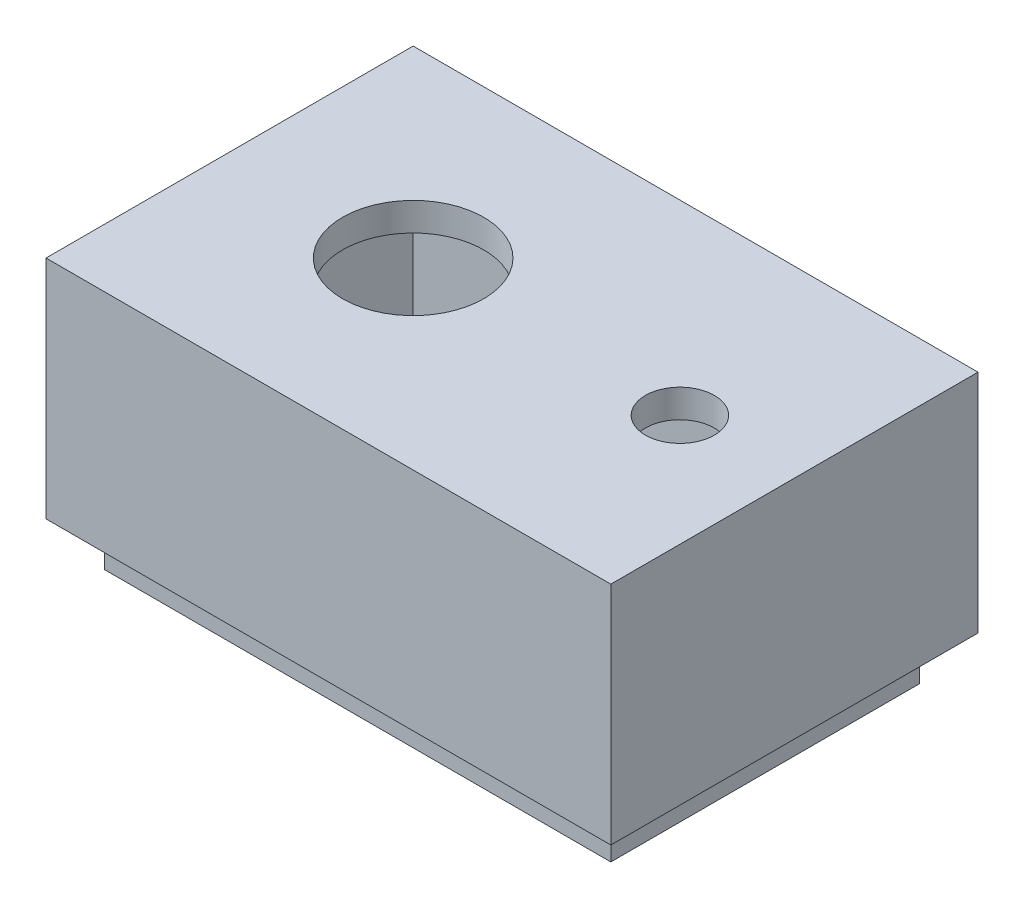
ISO-10303-21;
HEADER;
FILE_DESCRIPTION(('STEP AP214'),'2;1');
FILE_NAME('part.step','',(''),(''),'','','');
FILE_SCHEMA(('AUTOMOTIVE_DESIGN { 1 0 10303 214 1 1 1 1 }'));
ENDSEC;
DATA;
#1=APPLICATION_CONTEXT('core data for automotive mechanical design processes');
#2=APPLICATION_PROTOCOL_DEFINITION('international standard','automotive_design',2000,#1);
#3=PRODUCT_CONTEXT('',#1,'mechanical');
#4=PRODUCT('Part','Part','',(#3));
#5=PRODUCT_RELATED_PRODUCT_CATEGORY('part','',(#4));
#6=PRODUCT_DEFINITION_FORMATION('','',#4);
#7=PRODUCT_DEFINITION_CONTEXT('part definition',#1,'design');
#8=PRODUCT_DEFINITION('design','',#6,#7);
#9=PRODUCT_DEFINITION_SHAPE('','',#8);
#10=(LENGTH_UNIT() NAMED_UNIT(*) SI_UNIT(.MILLI.,.METRE.));
#11=(NAMED_UNIT(*) PLANE_ANGLE_UNIT() SI_UNIT($,.RADIAN.));
#12=(NAMED_UNIT(*) SI_UNIT($,.STERADIAN.) SOLID_ANGLE_UNIT());
#13=UNCERTAINTY_MEASURE_WITH_UNIT(LENGTH_MEASURE(1.E-05),#10,'distance_accuracy_value','');
#14=(GEOMETRIC_REPRESENTATION_CONTEXT(3) GLOBAL_UNCERTAINTY_ASSIGNED_CONTEXT((#13)) GLOBAL_UNIT_ASSIGNED_CONTEXT((#10,
#11,#12)) REPRESENTATION_CONTEXT('',''));
#15=CARTESIAN_POINT('',(0.,0.,0.));
#16=DIRECTION('',(0.,0.,1.));
#17=DIRECTION('',(1.,0.,0.));
#18=AXIS2_PLACEMENT_3D('',#15,#16,#17);
#19=CARTESIAN_POINT('',(0.,40.,0.));
#20=DIRECTION('',(0.,1.,0.));
#21=DIRECTION('',(0.,0.,1.));
#22=AXIS2_PLACEMENT_3D('',#19,#20,#21);
#23=PLANE('',#22);
#24=DIRECTION('',(0.,0.,1.));
#25=VECTOR('',#24,1.);
#26=CARTESIAN_POINT('',(55.9322033898305,40.,29.9992295839753));
#27=LINE('',#26,#25);
#28=CARTESIAN_POINT('',(55.9322033898305,40.,-33.0007704160247));
#29=VERTEX_POINT('',#28);
#30=CARTESIAN_POINT('',(55.9322033898305,40.,31.9992295839753));
#31=VERTEX_POINT('',#30);
#32=EDGE_CURVE('E94',#29,#31,#27,.T.);
#33=ORIENTED_EDGE('',*,*,#32,.T.);
#34=DIRECTION('',(1.,0.,0.));
#35=VECTOR('',#34,1.);
#36=CARTESIAN_POINT('',(-44.0677966101695,40.,31.9992295839753));
#37=LINE('',#36,#35);
#38=CARTESIAN_POINT('',(-44.0677966101695,40.,31.9992295839753));
#39=VERTEX_POINT('',#38);
#40=EDGE_CURVE('E251',#39,#31,#37,.T.);
#41=ORIENTED_EDGE('',*,*,#40,.F.);
#42=DIRECTION('',(0.,0.,1.));
#43=VECTOR('',#42,1.);
#44=CARTESIAN_POINT('',(-44.0677966101695,40.,-33.0007704160247));
#45=LINE('',#44,#43);
#46=CARTESIAN_POINT('',(-44.0677966101695,40.,-33.0007704160247));
#47=VERTEX_POINT('',#46);
#48=EDGE_CURVE('E237',#47,#39,#45,.T.);
#49=ORIENTED_EDGE('',*,*,#48,.F.);
#50=DIRECTION('',(-1.,0.,0.));
#51=VECTOR('',#50,1.);
#52=CARTESIAN_POINT('',(-44.0677966101695,40.,-33.0007704160247));
#53=LINE('',#52,#51);
#54=EDGE_CURVE('E249',#29,#47,#53,.T.);
#55=ORIENTED_EDGE('',*,*,#54,.F.);
#56=EDGE_LOOP('',(#33,#41,#49,#55));
#57=FACE_BOUND('',#56,.T.);
#58=DIRECTION('',(0.,0.,-1.));
#59=VECTOR('',#58,1.);
#60=CARTESIAN_POINT('',(-38.8677966101695,40.,26.7992295839754));
#61=LINE('',#60,#59);
#62=CARTESIAN_POINT('',(-38.8677966101695,40.,26.7992295839754));
#63=VERTEX_POINT('',#62);
#64=CARTESIAN_POINT('',(-38.8677966101695,40.,-27.8007704160247));
#65=VERTEX_POINT('',#64);
#66=EDGE_CURVE('E279',#63,#65,#61,.T.);
#67=ORIENTED_EDGE('',*,*,#66,.F.);
#68=DIRECTION('',(-1.,0.,0.));
#69=VECTOR('',#68,1.);
#70=CARTESIAN_POINT('',(-38.8677966101695,40.,26.7992295839754));
#71=LINE('',#70,#69);
#72=CARTESIAN_POINT('',(50.7322033898305,40.,26.7992295839754));
#73=VERTEX_POINT('',#72);
#74=EDGE_CURVE('E190',#73,#63,#71,.T.);
#75=ORIENTED_EDGE('',*,*,#74,.F.);
#76=DIRECTION('',(0.,0.,1.));
#77=VECTOR('',#76,1.);
#78=CARTESIAN_POINT('',(50.7322033898305,40.,26.7992295839754));
#79=LINE('',#78,#77);
#80=CARTESIAN_POINT('',(50.7322033898305,40.,-27.8007704160247));
#81=VERTEX_POINT('',#80);
#82=EDGE_CURVE('E195',#81,#73,#79,.T.);
#83=ORIENTED_EDGE('',*,*,#82,.F.);
#84=DIRECTION('',(1.,0.,0.));
#85=VECTOR('',#84,1.);
#86=CARTESIAN_POINT('',(-38.8677966101695,40.,-27.8007704160247));
#87=LINE('',#86,#85);
#88=EDGE_CURVE('E283',#65,#81,#87,.T.);
#89=ORIENTED_EDGE('',*,*,#88,.F.);
#90=EDGE_LOOP('',(#67,#75,#83,#89));
#91=FACE_BOUND('',#90,.T.);
#92=ADVANCED_FACE('F87',(#57,#91),#23,.F.);
#93=CARTESIAN_POINT('',(55.9322033898305,80.,-33.0007704160247));
#94=DIRECTION('',(-1.,0.,0.));
#95=DIRECTION('',(0.,0.,1.));
#96=AXIS2_PLACEMENT_3D('',#93,#94,#95);
#97=PLANE('',#96);
#98=DIRECTION('',(0.,-1.,0.));
#99=VECTOR('',#98,1.);
#100=CARTESIAN_POINT('',(55.9322033898305,80.,-33.0007704160247));
#101=LINE('',#100,#99);
#102=CARTESIAN_POINT('',(55.9322033898305,80.,-33.0007704160247));
#103=VERTEX_POINT('',#102);
#104=EDGE_CURVE('E224',#103,#29,#101,.T.);
#105=ORIENTED_EDGE('',*,*,#104,.F.);
#106=DIRECTION('',(0.,0.,-1.));
#107=VECTOR('',#106,1.);
#108=CARTESIAN_POINT('',(55.9322033898305,80.,-33.0007704160247));
#109=LINE('',#108,#107);
#110=CARTESIAN_POINT('',(55.9322033898305,80.,31.9992295839753));
#111=VERTEX_POINT('',#110);
#112=EDGE_CURVE('E242',#111,#103,#109,.T.);
#113=ORIENTED_EDGE('',*,*,#112,.F.);
#114=DIRECTION('',(0.,-1.,0.));
#115=VECTOR('',#114,1.);
#116=CARTESIAN_POINT('',(55.9322033898305,80.,31.9992295839753));
#117=LINE('',#116,#115);
#118=EDGE_CURVE('E221',#111,#31,#117,.T.);
#119=ORIENTED_EDGE('',*,*,#118,.T.);
#120=ORIENTED_EDGE('',*,*,#32,.F.);
#121=EDGE_LOOP('',(#105,#113,#119,#120));
#122=FACE_BOUND('',#121,.T.);
#123=ADVANCED_FACE('F264',(#122),#97,.F.);
#124=CARTESIAN_POINT('',(0.,75.,0.));
#125=DIRECTION('',(0.,1.,0.));
#126=DIRECTION('',(0.,0.,1.));
#127=AXIS2_PLACEMENT_3D('',#124,#125,#126);
#128=PLANE('',#127);
#129=DIRECTION('',(-1.,0.,0.));
#130=VECTOR('',#129,1.);
#131=CARTESIAN_POINT('',(-39.0677966101695,75.,25.7992295839754));
#132=LINE('',#131,#130);
#133=CARTESIAN_POINT('',(49.7322033898305,75.,25.7992295839754));
#134=VERTEX_POINT('',#133);
#135=CARTESIAN_POINT('',(-37.8677966101695,75.,25.7992295839754));
#136=VERTEX_POINT('',#135);
#137=EDGE_CURVE('E210',#134,#136,#132,.T.);
#138=ORIENTED_EDGE('',*,*,#137,.T.);
#139=DIRECTION('',(0.,0.,-1.));
#140=VECTOR('',#139,1.);
#141=CARTESIAN_POINT('',(-37.8677966101695,75.,26.9992295839753));
#142=LINE('',#141,#140);
#143=CARTESIAN_POINT('',(-37.8677966101695,75.,-26.8007704160247));
#144=VERTEX_POINT('',#143);
#145=EDGE_CURVE('E201',#136,#144,#142,.T.);
#146=ORIENTED_EDGE('',*,*,#145,.T.);
#147=DIRECTION('',(1.,0.,0.));
#148=VECTOR('',#147,1.);
#149=CARTESIAN_POINT('',(-39.0677966101695,75.,-26.8007704160247));
#150=LINE('',#149,#148);
#151=CARTESIAN_POINT('',(49.7322033898305,75.,-26.8007704160247));
#152=VERTEX_POINT('',#151);
#153=EDGE_CURVE('E204',#144,#152,#150,.T.);
#154=ORIENTED_EDGE('',*,*,#153,.T.);
#155=DIRECTION('',(0.,0.,1.));
#156=VECTOR('',#155,1.);
#157=CARTESIAN_POINT('',(49.7322033898305,75.,26.9992295839753));
#158=LINE('',#157,#156);
#159=EDGE_CURVE('E207',#152,#134,#158,.T.);
#160=ORIENTED_EDGE('',*,*,#159,.T.);
#161=EDGE_LOOP('',(#138,#146,#154,#160));
#162=FACE_BOUND('',#161,.T.);
#163=CARTESIAN_POINT('',(36.1553778472485,75.,0.));
#164=DIRECTION('',(0.,1.,0.));
#165=DIRECTION('',(0.,0.,1.));
#166=AXIS2_PLACEMENT_3D('',#163,#164,#165);
#167=CIRCLE('',#166,6.10322585973708);
#168=CARTESIAN_POINT('',(36.1553778472485,75.,6.10322585973708));
#169=VERTEX_POINT('',#168);
#170=EDGE_CURVE('E238',#169,#169,#167,.T.);
#171=ORIENTED_EDGE('',*,*,#170,.T.);
#172=EDGE_LOOP('',(#171));
#173=FACE_BOUND('',#172,.T.);
#174=CARTESIAN_POINT('',(-11.5677966101695,75.,-0.50077041602465));
#175=DIRECTION('',(0.,1.,0.));
#176=DIRECTION('',(0.,0.,1.));
#177=AXIS2_PLACEMENT_3D('',#174,#175,#176);
#178=CIRCLE('',#177,12.5);
#179=CARTESIAN_POINT('',(-11.5677966101695,75.,11.9992295839754));
#180=VERTEX_POINT('',#179);
#181=EDGE_CURVE('E284',#180,#180,#178,.T.);
#182=ORIENTED_EDGE('',*,*,#181,.T.);
#183=EDGE_LOOP('',(#182));
#184=FACE_BOUND('',#183,.T.);
#185=ADVANCED_FACE('F319',(#162,#173,#184),#128,.F.);
#186=CARTESIAN_POINT('',(36.1553778472485,75.,0.));
#187=DIRECTION('',(0.,1.,0.));
#188=DIRECTION('',(0.,0.,1.));
#189=AXIS2_PLACEMENT_3D('',#186,#187,#188);
#190=CYLINDRICAL_SURFACE('',#189,6.10322585973708);
#191=ORIENTED_EDGE('',*,*,#170,.F.);
#192=EDGE_LOOP('',(#191));
#193=FACE_BOUND('',#192,.T.);
#194=CARTESIAN_POINT('',(36.1553778472485,80.,0.));
#195=DIRECTION('',(0.,1.,0.));
#196=DIRECTION('',(0.,0.,1.));
#197=AXIS2_PLACEMENT_3D('',#194,#195,#196);
#198=CIRCLE('',#197,6.10322585973708);
#199=CARTESIAN_POINT('',(36.1553778472485,80.,6.10322585973708));
#200=VERTEX_POINT('',#199);
#201=EDGE_CURVE('E234',#200,#200,#198,.T.);
#202=ORIENTED_EDGE('',*,*,#201,.T.);
#203=EDGE_LOOP('',(#202));
#204=FACE_BOUND('',#203,.T.);
#205=ADVANCED_FACE('F327',(#193,#204),#190,.F.);
#206=CARTESIAN_POINT('',(-44.0677966101695,80.,-33.0007704160247));
#207=DIRECTION('',(0.,0.,1.));
#208=DIRECTION('',(1.,0.,0.));
#209=AXIS2_PLACEMENT_3D('',#206,#207,#208);
#210=PLANE('',#209);
#211=DIRECTION('',(0.,-1.,0.));
#212=VECTOR('',#211,1.);
#213=CARTESIAN_POINT('',(-44.0677966101695,80.,-33.0007704160247));
#214=LINE('',#213,#212);
#215=CARTESIAN_POINT('',(-44.0677966101695,80.,-33.0007704160247));
#216=VERTEX_POINT('',#215);
#217=EDGE_CURVE('E227',#216,#47,#214,.T.);
#218=ORIENTED_EDGE('',*,*,#217,.F.);
#219=DIRECTION('',(-1.,0.,0.));
#220=VECTOR('',#219,1.);
#221=CARTESIAN_POINT('',(-44.0677966101695,80.,-33.0007704160247));
#222=LINE('',#221,#220);
#223=EDGE_CURVE('E233',#103,#216,#222,.T.);
#224=ORIENTED_EDGE('',*,*,#223,.F.);
#225=ORIENTED_EDGE('',*,*,#104,.T.);
#226=ORIENTED_EDGE('',*,*,#54,.T.);
#227=EDGE_LOOP('',(#218,#224,#225,#226));
#228=FACE_BOUND('',#227,.T.);
#229=ADVANCED_FACE('F273',(#228),#210,.F.);
#230=CARTESIAN_POINT('',(-44.0677966101695,80.,31.9992295839753));
#231=DIRECTION('',(0.,0.,-1.));
#232=DIRECTION('',(-1.,0.,0.));
#233=AXIS2_PLACEMENT_3D('',#230,#231,#232);
#234=PLANE('',#233);
#235=ORIENTED_EDGE('',*,*,#40,.T.);
#236=ORIENTED_EDGE('',*,*,#118,.F.);
#237=DIRECTION('',(1.,0.,0.));
#238=VECTOR('',#237,1.);
#239=CARTESIAN_POINT('',(-44.0677966101695,80.,31.9992295839753));
#240=LINE('',#239,#238);
#241=CARTESIAN_POINT('',(-44.0677966101695,80.,31.9992295839753));
#242=VERTEX_POINT('',#241);
#243=EDGE_CURVE('E244',#242,#111,#240,.T.);
#244=ORIENTED_EDGE('',*,*,#243,.F.);
#245=DIRECTION('',(0.,-1.,0.));
#246=VECTOR('',#245,1.);
#247=CARTESIAN_POINT('',(-44.0677966101695,80.,31.9992295839753));
#248=LINE('',#247,#246);
#249=EDGE_CURVE('E230',#242,#39,#248,.T.);
#250=ORIENTED_EDGE('',*,*,#249,.T.);
#251=EDGE_LOOP('',(#235,#236,#244,#250));
#252=FACE_BOUND('',#251,.T.);
#253=ADVANCED_FACE('F256',(#252),#234,.F.);
#254=CARTESIAN_POINT('',(-44.0677966101695,80.,-33.0007704160247));
#255=DIRECTION('',(1.,0.,0.));
#256=DIRECTION('',(0.,0.,-1.));
#257=AXIS2_PLACEMENT_3D('',#254,#255,#256);
#258=PLANE('',#257);
#259=ORIENTED_EDGE('',*,*,#249,.F.);
#260=DIRECTION('',(0.,0.,1.));
#261=VECTOR('',#260,1.);
#262=CARTESIAN_POINT('',(-44.0677966101695,80.,-33.0007704160247));
#263=LINE('',#262,#261);
#264=EDGE_CURVE('E241',#216,#242,#263,.T.);
#265=ORIENTED_EDGE('',*,*,#264,.F.);
#266=ORIENTED_EDGE('',*,*,#217,.T.);
#267=ORIENTED_EDGE('',*,*,#48,.T.);
#268=EDGE_LOOP('',(#259,#265,#266,#267));
#269=FACE_BOUND('',#268,.T.);
#270=ADVANCED_FACE('F275',(#269),#258,.F.);
#271=CARTESIAN_POINT('',(0.,80.,0.));
#272=DIRECTION('',(0.,1.,0.));
#273=DIRECTION('',(0.,0.,1.));
#274=AXIS2_PLACEMENT_3D('',#271,#272,#273);
#275=PLANE('',#274);
#276=ORIENTED_EDGE('',*,*,#243,.T.);
#277=ORIENTED_EDGE('',*,*,#112,.T.);
#278=ORIENTED_EDGE('',*,*,#223,.T.);
#279=ORIENTED_EDGE('',*,*,#264,.T.);
#280=EDGE_LOOP('',(#276,#277,#278,#279));
#281=FACE_BOUND('',#280,.T.);
#282=ORIENTED_EDGE('',*,*,#201,.F.);
#283=EDGE_LOOP('',(#282));
#284=FACE_BOUND('',#283,.T.);
#285=CARTESIAN_POINT('',(-11.5677966101695,80.,-0.50077041602465));
#286=DIRECTION('',(0.,1.,0.));
#287=DIRECTION('',(0.,0.,1.));
#288=AXIS2_PLACEMENT_3D('',#285,#286,#287);
#289=CIRCLE('',#288,12.5);
#290=CARTESIAN_POINT('',(-11.5677966101695,80.,11.9992295839754));
#291=VERTEX_POINT('',#290);
#292=EDGE_CURVE('E288',#291,#291,#289,.T.);
#293=ORIENTED_EDGE('',*,*,#292,.F.);
#294=EDGE_LOOP('',(#293));
#295=FACE_BOUND('',#294,.T.);
#296=ADVANCED_FACE('F268',(#281,#284,#295),#275,.T.);
#297=CARTESIAN_POINT('',(-37.8677966101695,40.,26.9992295839753));
#298=DIRECTION('',(1.,0.,0.));
#299=DIRECTION('',(0.,0.,-1.));
#300=AXIS2_PLACEMENT_3D('',#297,#298,#299);
#301=PLANE('',#300);
#302=DIRECTION('',(0.,0.,1.));
#303=VECTOR('',#302,1.);
#304=CARTESIAN_POINT('',(-37.8677966101695,32.2018522868434,26.9992295839753));
#305=LINE('',#304,#303);
#306=CARTESIAN_POINT('',(-37.8677966101695,32.2018522868434,-26.8007704160247));
#307=VERTEX_POINT('',#306);
#308=CARTESIAN_POINT('',(-37.8677966101695,32.2018522868434,25.7992295839754));
#309=VERTEX_POINT('',#308);
#310=EDGE_CURVE('E101',#307,#309,#305,.T.);
#311=ORIENTED_EDGE('',*,*,#310,.F.);
#312=DIRECTION('',(0.,1.,0.));
#313=VECTOR('',#312,1.);
#314=CARTESIAN_POINT('',(-37.8677966101695,40.,-26.8007704160247));
#315=LINE('',#314,#313);
#316=EDGE_CURVE('E219',#307,#144,#315,.T.);
#317=ORIENTED_EDGE('',*,*,#316,.T.);
#318=ORIENTED_EDGE('',*,*,#145,.F.);
#319=DIRECTION('',(0.,1.,0.));
#320=VECTOR('',#319,1.);
#321=CARTESIAN_POINT('',(-37.8677966101695,40.,25.7992295839754));
#322=LINE('',#321,#320);
#323=EDGE_CURVE('E213',#309,#136,#322,.T.);
#324=ORIENTED_EDGE('',*,*,#323,.F.);
#325=EDGE_LOOP('',(#311,#317,#318,#324));
#326=FACE_BOUND('',#325,.T.);
#327=ADVANCED_FACE('F311',(#326),#301,.T.);
#328=CARTESIAN_POINT('',(-39.0677966101695,40.,-26.8007704160247));
#329=DIRECTION('',(0.,0.,1.));
#330=DIRECTION('',(1.,0.,0.));
#331=AXIS2_PLACEMENT_3D('',#328,#329,#330);
#332=PLANE('',#331);
#333=DIRECTION('',(-1.,0.,0.));
#334=VECTOR('',#333,1.);
#335=CARTESIAN_POINT('',(-39.0677966101695,32.2018522868434,-26.8007704160247));
#336=LINE('',#335,#334);
#337=CARTESIAN_POINT('',(49.7322033898305,32.2018522868434,-26.8007704160247));
#338=VERTEX_POINT('',#337);
#339=EDGE_CURVE('E303',#338,#307,#336,.T.);
#340=ORIENTED_EDGE('',*,*,#339,.F.);
#341=DIRECTION('',(0.,1.,0.));
#342=VECTOR('',#341,1.);
#343=CARTESIAN_POINT('',(49.7322033898305,40.,-26.8007704160247));
#344=LINE('',#343,#342);
#345=EDGE_CURVE('E217',#338,#152,#344,.T.);
#346=ORIENTED_EDGE('',*,*,#345,.T.);
#347=ORIENTED_EDGE('',*,*,#153,.F.);
#348=ORIENTED_EDGE('',*,*,#316,.F.);
#349=EDGE_LOOP('',(#340,#346,#347,#348));
#350=FACE_BOUND('',#349,.T.);
#351=ADVANCED_FACE('F316',(#350),#332,.T.);
#352=CARTESIAN_POINT('',(49.7322033898305,40.,26.9992295839753));
#353=DIRECTION('',(-1.,0.,0.));
#354=DIRECTION('',(0.,0.,1.));
#355=AXIS2_PLACEMENT_3D('',#352,#353,#354);
#356=PLANE('',#355);
#357=DIRECTION('',(0.,0.,-1.));
#358=VECTOR('',#357,1.);
#359=CARTESIAN_POINT('',(49.7322033898305,32.2018522868434,26.9992295839753));
#360=LINE('',#359,#358);
#361=CARTESIAN_POINT('',(49.7322033898305,32.2018522868434,25.7992295839754));
#362=VERTEX_POINT('',#361);
#363=EDGE_CURVE('E301',#362,#338,#360,.T.);
#364=ORIENTED_EDGE('',*,*,#363,.F.);
#365=DIRECTION('',(0.,1.,0.));
#366=VECTOR('',#365,1.);
#367=CARTESIAN_POINT('',(49.7322033898305,40.,25.7992295839754));
#368=LINE('',#367,#366);
#369=EDGE_CURVE('E215',#362,#134,#368,.T.);
#370=ORIENTED_EDGE('',*,*,#369,.T.);
#371=ORIENTED_EDGE('',*,*,#159,.F.);
#372=ORIENTED_EDGE('',*,*,#345,.F.);
#373=EDGE_LOOP('',(#364,#370,#371,#372));
#374=FACE_BOUND('',#373,.T.);
#375=ADVANCED_FACE('F368',(#374),#356,.T.);
#376=CARTESIAN_POINT('',(-39.0677966101695,40.,25.7992295839754));
#377=DIRECTION('',(0.,0.,-1.));
#378=DIRECTION('',(-1.,0.,0.));
#379=AXIS2_PLACEMENT_3D('',#376,#377,#378);
#380=PLANE('',#379);
#381=DIRECTION('',(1.,0.,0.));
#382=VECTOR('',#381,1.);
#383=CARTESIAN_POINT('',(-39.0677966101695,32.2018522868434,25.7992295839754));
#384=LINE('',#383,#382);
#385=EDGE_CURVE('E297',#309,#362,#384,.T.);
#386=ORIENTED_EDGE('',*,*,#385,.F.);
#387=ORIENTED_EDGE('',*,*,#323,.T.);
#388=ORIENTED_EDGE('',*,*,#137,.F.);
#389=ORIENTED_EDGE('',*,*,#369,.F.);
#390=EDGE_LOOP('',(#386,#387,#388,#389));
#391=FACE_BOUND('',#390,.T.);
#392=ADVANCED_FACE('F365',(#391),#380,.T.);
#393=CARTESIAN_POINT('',(-38.8677966101695,5.,26.7992295839754));
#394=DIRECTION('',(1.,0.,0.));
#395=DIRECTION('',(0.,0.,-1.));
#396=AXIS2_PLACEMENT_3D('',#393,#394,#395);
#397=PLANE('',#396);
#398=DIRECTION('',(0.,1.,0.));
#399=VECTOR('',#398,1.);
#400=CARTESIAN_POINT('',(-38.8677966101695,5.,-27.8007704160247));
#401=LINE('',#400,#399);
#402=CARTESIAN_POINT('',(-38.8677966101695,32.2018522868434,-27.8007704160247));
#403=VERTEX_POINT('',#402);
#404=EDGE_CURVE('E184',#403,#65,#401,.T.);
#405=ORIENTED_EDGE('',*,*,#404,.F.);
#406=DIRECTION('',(0.,0.,-1.));
#407=VECTOR('',#406,1.);
#408=CARTESIAN_POINT('',(-38.8677966101695,32.2018522868434,-27.8007704160247));
#409=LINE('',#408,#407);
#410=CARTESIAN_POINT('',(-38.8677966101695,32.2018522868434,26.7992295839754));
#411=VERTEX_POINT('',#410);
#412=EDGE_CURVE('E173',#411,#403,#409,.T.);
#413=ORIENTED_EDGE('',*,*,#412,.F.);
#414=DIRECTION('',(0.,1.,0.));
#415=VECTOR('',#414,1.);
#416=CARTESIAN_POINT('',(-38.8677966101695,5.,26.7992295839754));
#417=LINE('',#416,#415);
#418=EDGE_CURVE('E182',#411,#63,#417,.T.);
#419=ORIENTED_EDGE('',*,*,#418,.T.);
#420=ORIENTED_EDGE('',*,*,#66,.T.);
#421=EDGE_LOOP('',(#405,#413,#419,#420));
#422=FACE_BOUND('',#421,.T.);
#423=ADVANCED_FACE('F180',(#422),#397,.F.);
#424=CARTESIAN_POINT('',(-38.8677966101695,5.,-27.8007704160247));
#425=DIRECTION('',(0.,0.,1.));
#426=DIRECTION('',(1.,0.,0.));
#427=AXIS2_PLACEMENT_3D('',#424,#425,#426);
#428=PLANE('',#427);
#429=DIRECTION('',(0.,1.,0.));
#430=VECTOR('',#429,1.);
#431=CARTESIAN_POINT('',(50.7322033898305,5.,-27.8007704160247));
#432=LINE('',#431,#430);
#433=CARTESIAN_POINT('',(50.7322033898305,32.2018522868434,-27.8007704160246));
#434=VERTEX_POINT('',#433);
#435=EDGE_CURVE('E193',#434,#81,#432,.T.);
#436=ORIENTED_EDGE('',*,*,#435,.F.);
#437=DIRECTION('',(-1.,0.,0.));
#438=VECTOR('',#437,1.);
#439=CARTESIAN_POINT('',(76.1322033898305,32.2018522868434,-27.8007704160246));
#440=LINE('',#439,#438);
#441=EDGE_CURVE('E185',#434,#403,#440,.T.);
#442=ORIENTED_EDGE('',*,*,#441,.T.);
#443=ORIENTED_EDGE('',*,*,#404,.T.);
#444=ORIENTED_EDGE('',*,*,#88,.T.);
#445=EDGE_LOOP('',(#436,#442,#443,#444));
#446=FACE_BOUND('',#445,.T.);
#447=ADVANCED_FACE('F295',(#446),#428,.F.);
#448=CARTESIAN_POINT('',(50.7322033898305,5.,26.7992295839754));
#449=DIRECTION('',(-1.,0.,0.));
#450=DIRECTION('',(0.,0.,1.));
#451=AXIS2_PLACEMENT_3D('',#448,#449,#450);
#452=PLANE('',#451);
#453=DIRECTION('',(0.,1.,0.));
#454=VECTOR('',#453,1.);
#455=CARTESIAN_POINT('',(50.7322033898305,5.,26.7992295839754));
#456=LINE('',#455,#454);
#457=CARTESIAN_POINT('',(50.7322033898305,32.2018522868434,26.7992295839754));
#458=VERTEX_POINT('',#457);
#459=EDGE_CURVE('E191',#458,#73,#456,.T.);
#460=ORIENTED_EDGE('',*,*,#459,.F.);
#461=DIRECTION('',(0.,0.,-1.));
#462=VECTOR('',#461,1.);
#463=CARTESIAN_POINT('',(50.7322033898305,32.2018522868434,26.7992295839754));
#464=LINE('',#463,#462);
#465=EDGE_CURVE('E109',#458,#434,#464,.T.);
#466=ORIENTED_EDGE('',*,*,#465,.T.);
#467=ORIENTED_EDGE('',*,*,#435,.T.);
#468=ORIENTED_EDGE('',*,*,#82,.T.);
#469=EDGE_LOOP('',(#460,#466,#467,#468));
#470=FACE_BOUND('',#469,.T.);
#471=ADVANCED_FACE('F292',(#470),#452,.F.);
#472=CARTESIAN_POINT('',(-38.8677966101695,5.,26.7992295839754));
#473=DIRECTION('',(0.,0.,-1.));
#474=DIRECTION('',(-1.,0.,0.));
#475=AXIS2_PLACEMENT_3D('',#472,#473,#474);
#476=PLANE('',#475);
#477=ORIENTED_EDGE('',*,*,#418,.F.);
#478=DIRECTION('',(1.,0.,0.));
#479=VECTOR('',#478,1.);
#480=CARTESIAN_POINT('',(-38.8677966101695,32.2018522868434,26.7992295839754));
#481=LINE('',#480,#479);
#482=EDGE_CURVE('E12',#411,#458,#481,.T.);
#483=ORIENTED_EDGE('',*,*,#482,.T.);
#484=ORIENTED_EDGE('',*,*,#459,.T.);
#485=ORIENTED_EDGE('',*,*,#74,.T.);
#486=EDGE_LOOP('',(#477,#483,#484,#485));
#487=FACE_BOUND('',#486,.T.);
#488=ADVANCED_FACE('F188',(#487),#476,.F.);
#489=CARTESIAN_POINT('',(-11.5677966101695,75.,-0.50077041602465));
#490=DIRECTION('',(0.,1.,0.));
#491=DIRECTION('',(0.,0.,1.));
#492=AXIS2_PLACEMENT_3D('',#489,#490,#491);
#493=CYLINDRICAL_SURFACE('',#492,12.5);
#494=ORIENTED_EDGE('',*,*,#181,.F.);
#495=EDGE_LOOP('',(#494));
#496=FACE_BOUND('',#495,.T.);
#497=ORIENTED_EDGE('',*,*,#292,.T.);
#498=EDGE_LOOP('',(#497));
#499=FACE_BOUND('',#498,.T.);
#500=ADVANCED_FACE('F308',(#496,#499),#493,.F.);
#501=CARTESIAN_POINT('',(76.1322033898305,32.2018522868434,-27.8007704160246));
#502=DIRECTION('',(0.,1.,0.));
#503=DIRECTION('',(0.,0.,1.));
#504=AXIS2_PLACEMENT_3D('',#501,#502,#503);
#505=PLANE('',#504);
#506=ORIENTED_EDGE('',*,*,#310,.T.);
#507=ORIENTED_EDGE('',*,*,#385,.T.);
#508=ORIENTED_EDGE('',*,*,#363,.T.);
#509=ORIENTED_EDGE('',*,*,#339,.T.);
#510=EDGE_LOOP('',(#506,#507,#508,#509));
#511=FACE_BOUND('',#510,.T.);
#512=ORIENTED_EDGE('',*,*,#482,.F.);
#513=ORIENTED_EDGE('',*,*,#412,.T.);
#514=ORIENTED_EDGE('',*,*,#441,.F.);
#515=ORIENTED_EDGE('',*,*,#465,.F.);
#516=EDGE_LOOP('',(#512,#513,#514,#515));
#517=FACE_BOUND('',#516,.T.);
#518=ADVANCED_FACE('F172',(#511,#517),#505,.F.);
#519=CLOSED_SHELL('',(#92,#123,#185,#205,#229,#253,#270,#296,#327,#351,#375,#392,#423,#447,#471,
#488,#500,#518));
#520=MANIFOLD_SOLID_BREP('B2',#519);
#521=ADVANCED_BREP_SHAPE_REPRESENTATION('',(#18,#520),#14);
#522=SHAPE_DEFINITION_REPRESENTATION(#9,#521);
ENDSEC;
END-ISO-10303-21;
